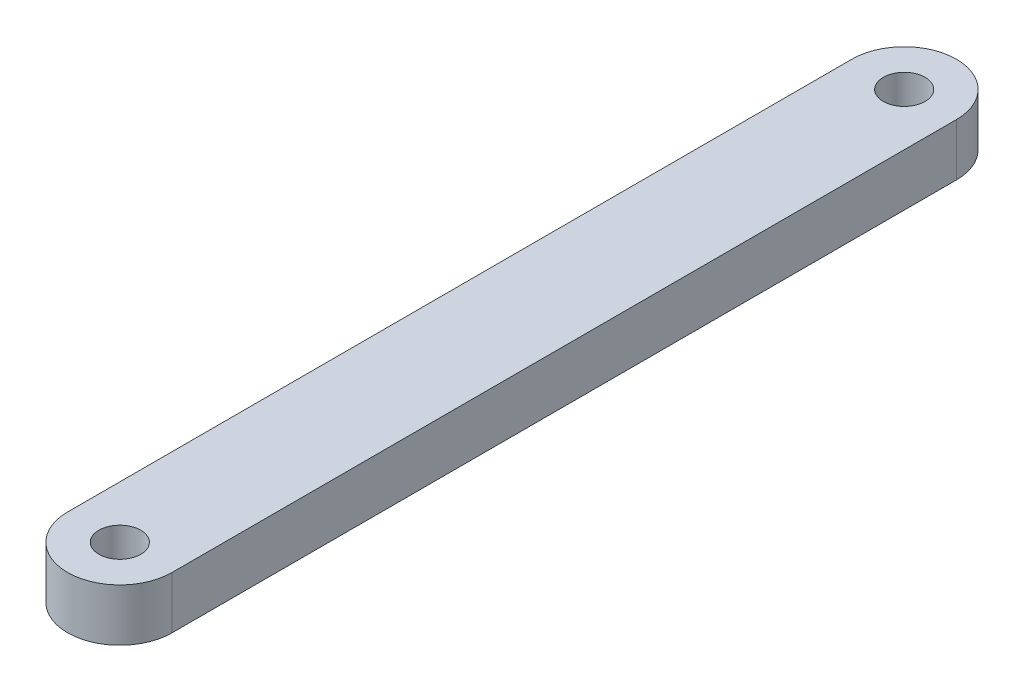
ISO-10303-21;
HEADER;
FILE_DESCRIPTION(('STEP AP214'),'2;1');
FILE_NAME('part.step','',(''),(''),'','','');
FILE_SCHEMA(('AUTOMOTIVE_DESIGN { 1 0 10303 214 1 1 1 1 }'));
ENDSEC;
DATA;
#1=APPLICATION_CONTEXT('core data for automotive mechanical design processes');
#2=APPLICATION_PROTOCOL_DEFINITION('international standard','automotive_design',2000,#1);
#3=PRODUCT_CONTEXT('',#1,'mechanical');
#4=PRODUCT('Part','Part','',(#3));
#5=PRODUCT_RELATED_PRODUCT_CATEGORY('part','',(#4));
#6=PRODUCT_DEFINITION_FORMATION('','',#4);
#7=PRODUCT_DEFINITION_CONTEXT('part definition',#1,'design');
#8=PRODUCT_DEFINITION('design','',#6,#7);
#9=PRODUCT_DEFINITION_SHAPE('','',#8);
#10=(LENGTH_UNIT() NAMED_UNIT(*) SI_UNIT(.MILLI.,.METRE.));
#11=(NAMED_UNIT(*) PLANE_ANGLE_UNIT() SI_UNIT($,.RADIAN.));
#12=(NAMED_UNIT(*) SI_UNIT($,.STERADIAN.) SOLID_ANGLE_UNIT());
#13=UNCERTAINTY_MEASURE_WITH_UNIT(LENGTH_MEASURE(1.E-05),#10,'distance_accuracy_value','');
#14=(GEOMETRIC_REPRESENTATION_CONTEXT(3) GLOBAL_UNCERTAINTY_ASSIGNED_CONTEXT((#13)) GLOBAL_UNIT_ASSIGNED_CONTEXT((#10,
#11,#12)) REPRESENTATION_CONTEXT('',''));
#15=CARTESIAN_POINT('',(0.,0.,0.));
#16=DIRECTION('',(0.,0.,1.));
#17=DIRECTION('',(1.,0.,0.));
#18=AXIS2_PLACEMENT_3D('',#15,#16,#17);
#19=CARTESIAN_POINT('',(0.,5.,-37.5));
#20=DIRECTION('',(0.,1.,0.));
#21=DIRECTION('',(0.,0.,1.));
#22=AXIS2_PLACEMENT_3D('',#19,#20,#21);
#23=PLANE('',#22);
#24=CARTESIAN_POINT('',(0.,5.,-37.5));
#25=DIRECTION('',(0.,1.,0.));
#26=DIRECTION('',(0.,0.,1.));
#27=AXIS2_PLACEMENT_3D('',#24,#25,#26);
#28=CIRCLE('',#27,2.);
#29=CARTESIAN_POINT('',(0.,5.,-35.5));
#30=VERTEX_POINT('',#29);
#31=EDGE_CURVE('E116',#30,#30,#28,.T.);
#32=ORIENTED_EDGE('',*,*,#31,.F.);
#33=EDGE_LOOP('',(#32));
#34=FACE_BOUND('',#33,.T.);
#35=CARTESIAN_POINT('',(0.,5.,-37.5));
#36=DIRECTION('',(0.,1.,0.));
#37=DIRECTION('',(0.,0.,1.));
#38=AXIS2_PLACEMENT_3D('',#35,#36,#37);
#39=CIRCLE('',#38,5.);
#40=CARTESIAN_POINT('',(4.99999999999999,5.,-37.5));
#41=VERTEX_POINT('',#40);
#42=CARTESIAN_POINT('',(-5.00000000000001,5.,-37.5));
#43=VERTEX_POINT('',#42);
#44=EDGE_CURVE('E96',#41,#43,#39,.T.);
#45=ORIENTED_EDGE('',*,*,#44,.T.);
#46=DIRECTION('',(0.,0.,1.));
#47=VECTOR('',#46,1.);
#48=CARTESIAN_POINT('',(-5.00000000000001,5.,-37.5));
#49=LINE('',#48,#47);
#50=CARTESIAN_POINT('',(-4.99999999999999,5.,37.5));
#51=VERTEX_POINT('',#50);
#52=EDGE_CURVE('E91',#43,#51,#49,.T.);
#53=ORIENTED_EDGE('',*,*,#52,.T.);
#54=CARTESIAN_POINT('',(0.,5.,37.5));
#55=DIRECTION('',(0.,1.,0.));
#56=DIRECTION('',(0.,0.,1.));
#57=AXIS2_PLACEMENT_3D('',#54,#55,#56);
#58=CIRCLE('',#57,5.);
#59=CARTESIAN_POINT('',(5.00000000000001,5.,37.5));
#60=VERTEX_POINT('',#59);
#61=EDGE_CURVE('E94',#51,#60,#58,.T.);
#62=ORIENTED_EDGE('',*,*,#61,.T.);
#63=DIRECTION('',(0.,0.,-1.));
#64=VECTOR('',#63,1.);
#65=CARTESIAN_POINT('',(4.99999999999999,5.,-37.5));
#66=LINE('',#65,#64);
#67=EDGE_CURVE('E61',#60,#41,#66,.T.);
#68=ORIENTED_EDGE('',*,*,#67,.T.);
#69=EDGE_LOOP('',(#45,#53,#62,#68));
#70=FACE_BOUND('',#69,.T.);
#71=CARTESIAN_POINT('',(0.,5.,37.5));
#72=DIRECTION('',(0.,1.,0.));
#73=DIRECTION('',(0.,0.,1.));
#74=AXIS2_PLACEMENT_3D('',#71,#72,#73);
#75=CIRCLE('',#74,2.);
#76=CARTESIAN_POINT('',(0.,5.,39.5));
#77=VERTEX_POINT('',#76);
#78=EDGE_CURVE('E138',#77,#77,#75,.T.);
#79=ORIENTED_EDGE('',*,*,#78,.F.);
#80=EDGE_LOOP('',(#79));
#81=FACE_BOUND('',#80,.T.);
#82=ADVANCED_FACE('F43',(#34,#70,#81),#23,.T.);
#83=CARTESIAN_POINT('',(0.,0.,-37.5));
#84=DIRECTION('',(0.,1.,0.));
#85=DIRECTION('',(0.,0.,1.));
#86=AXIS2_PLACEMENT_3D('',#83,#84,#85);
#87=PLANE('',#86);
#88=CARTESIAN_POINT('',(0.,0.,-37.5));
#89=DIRECTION('',(0.,1.,0.));
#90=DIRECTION('',(0.,0.,1.));
#91=AXIS2_PLACEMENT_3D('',#88,#89,#90);
#92=CIRCLE('',#91,5.);
#93=CARTESIAN_POINT('',(4.99999999999999,0.,-37.5));
#94=VERTEX_POINT('',#93);
#95=CARTESIAN_POINT('',(-5.00000000000001,0.,-37.5));
#96=VERTEX_POINT('',#95);
#97=EDGE_CURVE('E112',#94,#96,#92,.T.);
#98=ORIENTED_EDGE('',*,*,#97,.F.);
#99=DIRECTION('',(0.,0.,-1.));
#100=VECTOR('',#99,1.);
#101=CARTESIAN_POINT('',(4.99999999999999,0.,-37.5));
#102=LINE('',#101,#100);
#103=CARTESIAN_POINT('',(5.00000000000001,0.,37.5));
#104=VERTEX_POINT('',#103);
#105=EDGE_CURVE('E84',#104,#94,#102,.T.);
#106=ORIENTED_EDGE('',*,*,#105,.F.);
#107=CARTESIAN_POINT('',(0.,0.,37.5));
#108=DIRECTION('',(0.,1.,0.));
#109=DIRECTION('',(0.,0.,1.));
#110=AXIS2_PLACEMENT_3D('',#107,#108,#109);
#111=CIRCLE('',#110,5.);
#112=CARTESIAN_POINT('',(-4.99999999999999,0.,37.5));
#113=VERTEX_POINT('',#112);
#114=EDGE_CURVE('E78',#113,#104,#111,.T.);
#115=ORIENTED_EDGE('',*,*,#114,.F.);
#116=DIRECTION('',(0.,0.,1.));
#117=VECTOR('',#116,1.);
#118=CARTESIAN_POINT('',(-5.00000000000001,0.,-37.5));
#119=LINE('',#118,#117);
#120=EDGE_CURVE('E101',#96,#113,#119,.T.);
#121=ORIENTED_EDGE('',*,*,#120,.F.);
#122=EDGE_LOOP('',(#98,#106,#115,#121));
#123=FACE_BOUND('',#122,.T.);
#124=CARTESIAN_POINT('',(0.,0.,-37.5));
#125=DIRECTION('',(0.,1.,0.));
#126=DIRECTION('',(0.,0.,1.));
#127=AXIS2_PLACEMENT_3D('',#124,#125,#126);
#128=CIRCLE('',#127,2.);
#129=CARTESIAN_POINT('',(0.,0.,-35.5));
#130=VERTEX_POINT('',#129);
#131=EDGE_CURVE('E134',#130,#130,#128,.T.);
#132=ORIENTED_EDGE('',*,*,#131,.T.);
#133=EDGE_LOOP('',(#132));
#134=FACE_BOUND('',#133,.T.);
#135=CARTESIAN_POINT('',(0.,0.,37.5));
#136=DIRECTION('',(0.,1.,0.));
#137=DIRECTION('',(0.,0.,1.));
#138=AXIS2_PLACEMENT_3D('',#135,#136,#137);
#139=CIRCLE('',#138,2.);
#140=CARTESIAN_POINT('',(0.,0.,39.5));
#141=VERTEX_POINT('',#140);
#142=EDGE_CURVE('E142',#141,#141,#139,.T.);
#143=ORIENTED_EDGE('',*,*,#142,.T.);
#144=EDGE_LOOP('',(#143));
#145=FACE_BOUND('',#144,.T.);
#146=ADVANCED_FACE('F129',(#123,#134,#145),#87,.F.);
#147=CARTESIAN_POINT('',(0.,5.,-37.5));
#148=DIRECTION('',(0.,-1.,0.));
#149=DIRECTION('',(0.,0.,-1.));
#150=AXIS2_PLACEMENT_3D('',#147,#148,#149);
#151=CYLINDRICAL_SURFACE('',#150,5.);
#152=ORIENTED_EDGE('',*,*,#97,.T.);
#153=DIRECTION('',(0.,-1.,0.));
#154=VECTOR('',#153,1.);
#155=CARTESIAN_POINT('',(-5.00000000000001,5.,-37.5));
#156=LINE('',#155,#154);
#157=EDGE_CURVE('E11',#43,#96,#156,.T.);
#158=ORIENTED_EDGE('',*,*,#157,.F.);
#159=ORIENTED_EDGE('',*,*,#44,.F.);
#160=DIRECTION('',(0.,-1.,0.));
#161=VECTOR('',#160,1.);
#162=CARTESIAN_POINT('',(4.99999999999999,5.,-37.5));
#163=LINE('',#162,#161);
#164=EDGE_CURVE('E108',#41,#94,#163,.T.);
#165=ORIENTED_EDGE('',*,*,#164,.T.);
#166=EDGE_LOOP('',(#152,#158,#159,#165));
#167=FACE_BOUND('',#166,.T.);
#168=ADVANCED_FACE('F45',(#167),#151,.T.);
#169=CARTESIAN_POINT('',(-5.00000000000001,5.,-37.5));
#170=DIRECTION('',(1.,0.,0.));
#171=DIRECTION('',(0.,0.,-1.));
#172=AXIS2_PLACEMENT_3D('',#169,#170,#171);
#173=PLANE('',#172);
#174=ORIENTED_EDGE('',*,*,#120,.T.);
#175=DIRECTION('',(0.,-1.,0.));
#176=VECTOR('',#175,1.);
#177=CARTESIAN_POINT('',(-4.99999999999999,5.,37.5));
#178=LINE('',#177,#176);
#179=EDGE_CURVE('E53',#51,#113,#178,.T.);
#180=ORIENTED_EDGE('',*,*,#179,.F.);
#181=ORIENTED_EDGE('',*,*,#52,.F.);
#182=ORIENTED_EDGE('',*,*,#157,.T.);
#183=EDGE_LOOP('',(#174,#180,#181,#182));
#184=FACE_BOUND('',#183,.T.);
#185=ADVANCED_FACE('F100',(#184),#173,.F.);
#186=CARTESIAN_POINT('',(0.,5.,37.5));
#187=DIRECTION('',(0.,-1.,0.));
#188=DIRECTION('',(0.,0.,-1.));
#189=AXIS2_PLACEMENT_3D('',#186,#187,#188);
#190=CYLINDRICAL_SURFACE('',#189,5.);
#191=ORIENTED_EDGE('',*,*,#114,.T.);
#192=DIRECTION('',(0.,-1.,0.));
#193=VECTOR('',#192,1.);
#194=CARTESIAN_POINT('',(5.00000000000001,5.,37.5));
#195=LINE('',#194,#193);
#196=EDGE_CURVE('E103',#60,#104,#195,.T.);
#197=ORIENTED_EDGE('',*,*,#196,.F.);
#198=ORIENTED_EDGE('',*,*,#61,.F.);
#199=ORIENTED_EDGE('',*,*,#179,.T.);
#200=EDGE_LOOP('',(#191,#197,#198,#199));
#201=FACE_BOUND('',#200,.T.);
#202=ADVANCED_FACE('F104',(#201),#190,.T.);
#203=CARTESIAN_POINT('',(4.99999999999999,5.,-37.5));
#204=DIRECTION('',(-1.,0.,0.));
#205=DIRECTION('',(0.,0.,1.));
#206=AXIS2_PLACEMENT_3D('',#203,#204,#205);
#207=PLANE('',#206);
#208=ORIENTED_EDGE('',*,*,#105,.T.);
#209=ORIENTED_EDGE('',*,*,#164,.F.);
#210=ORIENTED_EDGE('',*,*,#67,.F.);
#211=ORIENTED_EDGE('',*,*,#196,.T.);
#212=EDGE_LOOP('',(#208,#209,#210,#211));
#213=FACE_BOUND('',#212,.T.);
#214=ADVANCED_FACE('F126',(#213),#207,.F.);
#215=CARTESIAN_POINT('',(0.,5.,-37.5));
#216=DIRECTION('',(0.,-1.,0.));
#217=DIRECTION('',(0.,0.,-1.));
#218=AXIS2_PLACEMENT_3D('',#215,#216,#217);
#219=CYLINDRICAL_SURFACE('',#218,2.);
#220=ORIENTED_EDGE('',*,*,#31,.T.);
#221=EDGE_LOOP('',(#220));
#222=FACE_BOUND('',#221,.T.);
#223=ORIENTED_EDGE('',*,*,#131,.F.);
#224=EDGE_LOOP('',(#223));
#225=FACE_BOUND('',#224,.T.);
#226=ADVANCED_FACE('F161',(#222,#225),#219,.F.);
#227=CARTESIAN_POINT('',(0.,5.,37.5));
#228=DIRECTION('',(0.,-1.,0.));
#229=DIRECTION('',(0.,0.,-1.));
#230=AXIS2_PLACEMENT_3D('',#227,#228,#229);
#231=CYLINDRICAL_SURFACE('',#230,2.);
#232=ORIENTED_EDGE('',*,*,#78,.T.);
#233=EDGE_LOOP('',(#232));
#234=FACE_BOUND('',#233,.T.);
#235=ORIENTED_EDGE('',*,*,#142,.F.);
#236=EDGE_LOOP('',(#235));
#237=FACE_BOUND('',#236,.T.);
#238=ADVANCED_FACE('F150',(#234,#237),#231,.F.);
#239=CLOSED_SHELL('',(#82,#146,#168,#185,#202,#214,#226,#238));
#240=MANIFOLD_SOLID_BREP('B2',#239);
#241=ADVANCED_BREP_SHAPE_REPRESENTATION('',(#18,#240),#14);
#242=SHAPE_DEFINITION_REPRESENTATION(#9,#241);
ENDSEC;
END-ISO-10303-21;
